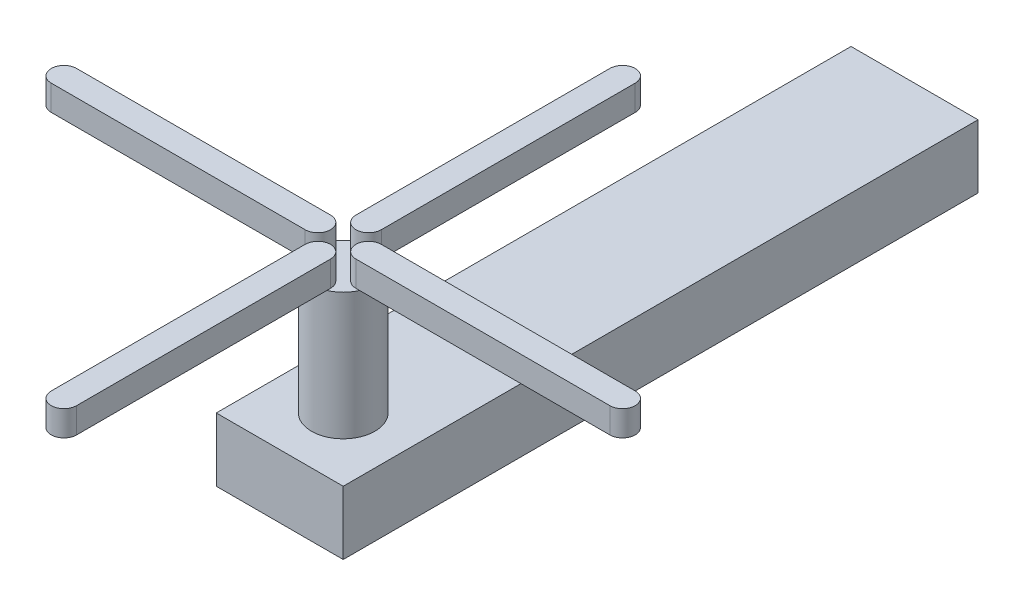
ISO-10303-21;
HEADER;
FILE_DESCRIPTION(('STEP AP214'),'2;1');
FILE_NAME('part.step','',(''),(''),'','','');
FILE_SCHEMA(('AUTOMOTIVE_DESIGN { 1 0 10303 214 1 1 1 1 }'));
ENDSEC;
DATA;
#1=APPLICATION_CONTEXT('core data for automotive mechanical design processes');
#2=APPLICATION_PROTOCOL_DEFINITION('international standard','automotive_design',2000,#1);
#3=PRODUCT_CONTEXT('',#1,'mechanical');
#4=PRODUCT('Part','Part','',(#3));
#5=PRODUCT_RELATED_PRODUCT_CATEGORY('part','',(#4));
#6=PRODUCT_DEFINITION_FORMATION('','',#4);
#7=PRODUCT_DEFINITION_CONTEXT('part definition',#1,'design');
#8=PRODUCT_DEFINITION('design','',#6,#7);
#9=PRODUCT_DEFINITION_SHAPE('','',#8);
#10=(LENGTH_UNIT() NAMED_UNIT(*) SI_UNIT(.MILLI.,.METRE.));
#11=(NAMED_UNIT(*) PLANE_ANGLE_UNIT() SI_UNIT($,.RADIAN.));
#12=(NAMED_UNIT(*) SI_UNIT($,.STERADIAN.) SOLID_ANGLE_UNIT());
#13=UNCERTAINTY_MEASURE_WITH_UNIT(LENGTH_MEASURE(1.E-05),#10,'distance_accuracy_value','');
#14=(GEOMETRIC_REPRESENTATION_CONTEXT(3) GLOBAL_UNCERTAINTY_ASSIGNED_CONTEXT((#13)) GLOBAL_UNIT_ASSIGNED_CONTEXT((#10,
#11,#12)) REPRESENTATION_CONTEXT('',''));
#15=CARTESIAN_POINT('',(0.,0.,0.));
#16=DIRECTION('',(0.,0.,1.));
#17=DIRECTION('',(1.,0.,0.));
#18=AXIS2_PLACEMENT_3D('',#15,#16,#17);
#19=CARTESIAN_POINT('',(0.,31.75,114.3));
#20=DIRECTION('',(0.,1.,0.));
#21=DIRECTION('',(0.,0.,1.));
#22=AXIS2_PLACEMENT_3D('',#19,#20,#21);
#23=PLANE('',#22);
#24=CARTESIAN_POINT('',(0.,31.75,114.3));
#25=DIRECTION('',(0.,1.,0.));
#26=DIRECTION('',(0.,0.,1.));
#27=AXIS2_PLACEMENT_3D('',#24,#25,#26);
#28=CIRCLE('',#27,6.35);
#29=CARTESIAN_POINT('',(5.81987113259391,31.75,111.76));
#30=VERTEX_POINT('',#29);
#31=CARTESIAN_POINT('',(2.54000000000006,31.75,108.480128867406));
#32=VERTEX_POINT('',#31);
#33=EDGE_CURVE('E341',#30,#32,#28,.T.);
#34=ORIENTED_EDGE('',*,*,#33,.T.);
#35=DIRECTION('',(0.,0.,-1.));
#36=VECTOR('',#35,1.);
#37=CARTESIAN_POINT('',(2.54000000000006,31.75,109.22));
#38=LINE('',#37,#36);
#39=CARTESIAN_POINT('',(2.54000000000006,31.75,109.22));
#40=VERTEX_POINT('',#39);
#41=EDGE_CURVE('E52',#40,#32,#38,.T.);
#42=ORIENTED_EDGE('',*,*,#41,.F.);
#43=CARTESIAN_POINT('',(0.,31.75,109.22));
#44=DIRECTION('',(0.,1.,0.));
#45=DIRECTION('',(0.,0.,1.));
#46=AXIS2_PLACEMENT_3D('',#43,#44,#45);
#47=CIRCLE('',#46,2.54);
#48=CARTESIAN_POINT('',(-2.53999999999994,31.75,109.22));
#49=VERTEX_POINT('',#48);
#50=EDGE_CURVE('E57',#49,#40,#47,.T.);
#51=ORIENTED_EDGE('',*,*,#50,.F.);
#52=DIRECTION('',(0.,0.,1.));
#53=VECTOR('',#52,1.);
#54=CARTESIAN_POINT('',(-2.53999999999994,31.75,109.22));
#55=LINE('',#54,#53);
#56=CARTESIAN_POINT('',(-2.53999999999994,31.75,108.480128867406));
#57=VERTEX_POINT('',#56);
#58=EDGE_CURVE('E224',#57,#49,#55,.T.);
#59=ORIENTED_EDGE('',*,*,#58,.F.);
#60=CARTESIAN_POINT('',(-5.81987113259388,31.75,111.76));
#61=VERTEX_POINT('',#60);
#62=EDGE_CURVE('E342',#57,#61,#28,.T.);
#63=ORIENTED_EDGE('',*,*,#62,.T.);
#64=DIRECTION('',(-1.,0.,0.));
#65=VECTOR('',#64,1.);
#66=CARTESIAN_POINT('',(-5.07999999999998,31.75,111.76));
#67=LINE('',#66,#65);
#68=CARTESIAN_POINT('',(-5.07999999999998,31.75,111.76));
#69=VERTEX_POINT('',#68);
#70=EDGE_CURVE('E258',#69,#61,#67,.T.);
#71=ORIENTED_EDGE('',*,*,#70,.F.);
#72=CARTESIAN_POINT('',(-5.08,31.75,114.3));
#73=DIRECTION('',(0.,1.,0.));
#74=DIRECTION('',(0.,0.,1.));
#75=AXIS2_PLACEMENT_3D('',#72,#73,#74);
#76=CIRCLE('',#75,2.54);
#77=CARTESIAN_POINT('',(-5.08000000000002,31.75,116.84));
#78=VERTEX_POINT('',#77);
#79=EDGE_CURVE('E261',#78,#69,#76,.T.);
#80=ORIENTED_EDGE('',*,*,#79,.F.);
#81=DIRECTION('',(1.,0.,0.));
#82=VECTOR('',#81,1.);
#83=CARTESIAN_POINT('',(-5.08000000000002,31.75,116.84));
#84=LINE('',#83,#82);
#85=CARTESIAN_POINT('',(-5.81987113259395,31.75,116.84));
#86=VERTEX_POINT('',#85);
#87=EDGE_CURVE('E255',#86,#78,#84,.T.);
#88=ORIENTED_EDGE('',*,*,#87,.F.);
#89=CARTESIAN_POINT('',(-2.54000000000002,31.75,120.119871132594));
#90=VERTEX_POINT('',#89);
#91=EDGE_CURVE('E402',#86,#90,#28,.T.);
#92=ORIENTED_EDGE('',*,*,#91,.T.);
#93=DIRECTION('',(0.,0.,1.));
#94=VECTOR('',#93,1.);
#95=CARTESIAN_POINT('',(-2.54000000000001,31.75,119.38));
#96=LINE('',#95,#94);
#97=CARTESIAN_POINT('',(-2.54000000000001,31.75,119.38));
#98=VERTEX_POINT('',#97);
#99=EDGE_CURVE('E290',#98,#90,#96,.T.);
#100=ORIENTED_EDGE('',*,*,#99,.F.);
#101=CARTESIAN_POINT('',(0.,31.75,119.38));
#102=DIRECTION('',(0.,1.,0.));
#103=DIRECTION('',(0.,0.,1.));
#104=AXIS2_PLACEMENT_3D('',#101,#102,#103);
#105=CIRCLE('',#104,2.54);
#106=CARTESIAN_POINT('',(2.53999999999999,31.75,119.38));
#107=VERTEX_POINT('',#106);
#108=EDGE_CURVE('E293',#107,#98,#105,.T.);
#109=ORIENTED_EDGE('',*,*,#108,.F.);
#110=DIRECTION('',(0.,0.,1.));
#111=VECTOR('',#110,1.);
#112=CARTESIAN_POINT('',(2.54,31.75,114.3));
#113=LINE('',#112,#111);
#114=CARTESIAN_POINT('',(2.53999999999998,31.75,120.119871132594));
#115=VERTEX_POINT('',#114);
#116=EDGE_CURVE('E11',#107,#115,#113,.T.);
#117=ORIENTED_EDGE('',*,*,#116,.T.);
#118=CARTESIAN_POINT('',(5.81987113259391,31.75,116.84));
#119=VERTEX_POINT('',#118);
#120=EDGE_CURVE('E336',#115,#119,#28,.T.);
#121=ORIENTED_EDGE('',*,*,#120,.T.);
#122=DIRECTION('',(1.,0.,0.));
#123=VECTOR('',#122,1.);
#124=CARTESIAN_POINT('',(5.08,31.75,116.84));
#125=LINE('',#124,#123);
#126=CARTESIAN_POINT('',(5.08,31.75,116.84));
#127=VERTEX_POINT('',#126);
#128=EDGE_CURVE('E318',#127,#119,#125,.T.);
#129=ORIENTED_EDGE('',*,*,#128,.F.);
#130=CARTESIAN_POINT('',(5.08,31.75,114.3));
#131=DIRECTION('',(0.,1.,0.));
#132=DIRECTION('',(0.,0.,1.));
#133=AXIS2_PLACEMENT_3D('',#130,#131,#132);
#134=CIRCLE('',#133,2.54);
#135=CARTESIAN_POINT('',(5.08,31.75,111.76));
#136=VERTEX_POINT('',#135);
#137=EDGE_CURVE('E296',#136,#127,#134,.T.);
#138=ORIENTED_EDGE('',*,*,#137,.F.);
#139=DIRECTION('',(-1.,0.,0.));
#140=VECTOR('',#139,1.);
#141=CARTESIAN_POINT('',(5.08,31.75,111.76));
#142=LINE('',#141,#140);
#143=EDGE_CURVE('E45',#30,#136,#142,.T.);
#144=ORIENTED_EDGE('',*,*,#143,.F.);
#145=EDGE_LOOP('',(#34,#42,#51,#59,#63,#71,#80,#88,#92,#100,#109,#117,#121,#129,#138,#144));
#146=FACE_BOUND('',#145,.T.);
#147=ADVANCED_FACE('F37',(#146),#23,.T.);
#148=CARTESIAN_POINT('',(-12.7,6.35,127.));
#149=DIRECTION('',(1.,0.,0.));
#150=DIRECTION('',(0.,0.,-1.));
#151=AXIS2_PLACEMENT_3D('',#148,#149,#150);
#152=PLANE('',#151);
#153=DIRECTION('',(0.,-1.,0.));
#154=VECTOR('',#153,1.);
#155=CARTESIAN_POINT('',(-12.7,6.35,0.));
#156=LINE('',#155,#154);
#157=CARTESIAN_POINT('',(-12.7,6.35,0.));
#158=VERTEX_POINT('',#157);
#159=CARTESIAN_POINT('',(-12.7,-6.35,0.));
#160=VERTEX_POINT('',#159);
#161=EDGE_CURVE('E340',#158,#160,#156,.T.);
#162=ORIENTED_EDGE('',*,*,#161,.T.);
#163=DIRECTION('',(0.,0.,-1.));
#164=VECTOR('',#163,1.);
#165=CARTESIAN_POINT('',(-12.7,-6.35,127.));
#166=LINE('',#165,#164);
#167=CARTESIAN_POINT('',(-12.7,-6.35,127.));
#168=VERTEX_POINT('',#167);
#169=EDGE_CURVE('E369',#168,#160,#166,.T.);
#170=ORIENTED_EDGE('',*,*,#169,.F.);
#171=DIRECTION('',(0.,-1.,0.));
#172=VECTOR('',#171,1.);
#173=CARTESIAN_POINT('',(-12.7,6.35,127.));
#174=LINE('',#173,#172);
#175=CARTESIAN_POINT('',(-12.7,6.35,127.));
#176=VERTEX_POINT('',#175);
#177=EDGE_CURVE('E343',#176,#168,#174,.T.);
#178=ORIENTED_EDGE('',*,*,#177,.F.);
#179=DIRECTION('',(0.,0.,-1.));
#180=VECTOR('',#179,1.);
#181=CARTESIAN_POINT('',(-12.7,6.35,127.));
#182=LINE('',#181,#180);
#183=EDGE_CURVE('E353',#176,#158,#182,.T.);
#184=ORIENTED_EDGE('',*,*,#183,.T.);
#185=EDGE_LOOP('',(#162,#170,#178,#184));
#186=FACE_BOUND('',#185,.T.);
#187=ADVANCED_FACE('F39',(#186),#152,.F.);
#188=CARTESIAN_POINT('',(-12.7,-6.35,127.));
#189=DIRECTION('',(0.,1.,0.));
#190=DIRECTION('',(0.,0.,1.));
#191=AXIS2_PLACEMENT_3D('',#188,#189,#190);
#192=PLANE('',#191);
#193=DIRECTION('',(1.,0.,0.));
#194=VECTOR('',#193,1.);
#195=CARTESIAN_POINT('',(-12.7,-6.35,0.));
#196=LINE('',#195,#194);
#197=CARTESIAN_POINT('',(12.7,-6.35,0.));
#198=VERTEX_POINT('',#197);
#199=EDGE_CURVE('E356',#160,#198,#196,.T.);
#200=ORIENTED_EDGE('',*,*,#199,.T.);
#201=DIRECTION('',(0.,0.,-1.));
#202=VECTOR('',#201,1.);
#203=CARTESIAN_POINT('',(12.7,-6.35,127.));
#204=LINE('',#203,#202);
#205=CARTESIAN_POINT('',(12.7,-6.35,127.));
#206=VERTEX_POINT('',#205);
#207=EDGE_CURVE('E366',#206,#198,#204,.T.);
#208=ORIENTED_EDGE('',*,*,#207,.F.);
#209=DIRECTION('',(1.,0.,0.));
#210=VECTOR('',#209,1.);
#211=CARTESIAN_POINT('',(-12.7,-6.35,127.));
#212=LINE('',#211,#210);
#213=EDGE_CURVE('E346',#168,#206,#212,.T.);
#214=ORIENTED_EDGE('',*,*,#213,.F.);
#215=ORIENTED_EDGE('',*,*,#169,.T.);
#216=EDGE_LOOP('',(#200,#208,#214,#215));
#217=FACE_BOUND('',#216,.T.);
#218=ADVANCED_FACE('F449',(#217),#192,.F.);
#219=CARTESIAN_POINT('',(12.7,6.35,127.));
#220=DIRECTION('',(-1.,0.,0.));
#221=DIRECTION('',(0.,0.,1.));
#222=AXIS2_PLACEMENT_3D('',#219,#220,#221);
#223=PLANE('',#222);
#224=DIRECTION('',(0.,1.,0.));
#225=VECTOR('',#224,1.);
#226=CARTESIAN_POINT('',(12.7,6.35,0.));
#227=LINE('',#226,#225);
#228=CARTESIAN_POINT('',(12.7,6.35,0.));
#229=VERTEX_POINT('',#228);
#230=EDGE_CURVE('E358',#198,#229,#227,.T.);
#231=ORIENTED_EDGE('',*,*,#230,.T.);
#232=DIRECTION('',(0.,0.,-1.));
#233=VECTOR('',#232,1.);
#234=CARTESIAN_POINT('',(12.7,6.35,127.));
#235=LINE('',#234,#233);
#236=CARTESIAN_POINT('',(12.7,6.35,127.));
#237=VERTEX_POINT('',#236);
#238=EDGE_CURVE('E363',#237,#229,#235,.T.);
#239=ORIENTED_EDGE('',*,*,#238,.F.);
#240=DIRECTION('',(0.,1.,0.));
#241=VECTOR('',#240,1.);
#242=CARTESIAN_POINT('',(12.7,6.35,127.));
#243=LINE('',#242,#241);
#244=EDGE_CURVE('E349',#206,#237,#243,.T.);
#245=ORIENTED_EDGE('',*,*,#244,.F.);
#246=ORIENTED_EDGE('',*,*,#207,.T.);
#247=EDGE_LOOP('',(#231,#239,#245,#246));
#248=FACE_BOUND('',#247,.T.);
#249=ADVANCED_FACE('F467',(#248),#223,.F.);
#250=CARTESIAN_POINT('',(-12.7,6.35,127.));
#251=DIRECTION('',(0.,-1.,0.));
#252=DIRECTION('',(0.,0.,-1.));
#253=AXIS2_PLACEMENT_3D('',#250,#251,#252);
#254=PLANE('',#253);
#255=CARTESIAN_POINT('',(0.,6.35,114.3));
#256=DIRECTION('',(0.,-1.,0.));
#257=DIRECTION('',(0.,0.,-1.));
#258=AXIS2_PLACEMENT_3D('',#255,#256,#257);
#259=CIRCLE('',#258,6.35);
#260=CARTESIAN_POINT('',(0.,6.35,107.95));
#261=VERTEX_POINT('',#260);
#262=EDGE_CURVE('E371',#261,#261,#259,.F.);
#263=ORIENTED_EDGE('',*,*,#262,.F.);
#264=EDGE_LOOP('',(#263));
#265=FACE_BOUND('',#264,.T.);
#266=DIRECTION('',(-1.,0.,0.));
#267=VECTOR('',#266,1.);
#268=CARTESIAN_POINT('',(-12.7,6.35,0.));
#269=LINE('',#268,#267);
#270=EDGE_CURVE('E347',#229,#158,#269,.T.);
#271=ORIENTED_EDGE('',*,*,#270,.T.);
#272=ORIENTED_EDGE('',*,*,#183,.F.);
#273=DIRECTION('',(-1.,0.,0.));
#274=VECTOR('',#273,1.);
#275=CARTESIAN_POINT('',(-12.7,6.35,127.));
#276=LINE('',#275,#274);
#277=EDGE_CURVE('E351',#237,#176,#276,.T.);
#278=ORIENTED_EDGE('',*,*,#277,.F.);
#279=ORIENTED_EDGE('',*,*,#238,.T.);
#280=EDGE_LOOP('',(#271,#272,#278,#279));
#281=FACE_BOUND('',#280,.T.);
#282=ADVANCED_FACE('F460',(#265,#281),#254,.F.);
#283=CARTESIAN_POINT('',(0.,0.,127.));
#284=DIRECTION('',(0.,0.,1.));
#285=DIRECTION('',(1.,0.,0.));
#286=AXIS2_PLACEMENT_3D('',#283,#284,#285);
#287=PLANE('',#286);
#288=ORIENTED_EDGE('',*,*,#177,.T.);
#289=ORIENTED_EDGE('',*,*,#213,.T.);
#290=ORIENTED_EDGE('',*,*,#244,.T.);
#291=ORIENTED_EDGE('',*,*,#277,.T.);
#292=EDGE_LOOP('',(#288,#289,#290,#291));
#293=FACE_BOUND('',#292,.T.);
#294=ADVANCED_FACE('F457',(#293),#287,.T.);
#295=CARTESIAN_POINT('',(0.,0.,0.));
#296=DIRECTION('',(0.,0.,1.));
#297=DIRECTION('',(1.,0.,0.));
#298=AXIS2_PLACEMENT_3D('',#295,#296,#297);
#299=PLANE('',#298);
#300=ORIENTED_EDGE('',*,*,#161,.F.);
#301=ORIENTED_EDGE('',*,*,#270,.F.);
#302=ORIENTED_EDGE('',*,*,#230,.F.);
#303=ORIENTED_EDGE('',*,*,#199,.F.);
#304=EDGE_LOOP('',(#300,#301,#302,#303));
#305=FACE_BOUND('',#304,.T.);
#306=ADVANCED_FACE('F456',(#305),#299,.F.);
#307=CARTESIAN_POINT('',(0.,31.75,114.3));
#308=DIRECTION('',(0.,-1.,0.));
#309=DIRECTION('',(0.,0.,-1.));
#310=AXIS2_PLACEMENT_3D('',#307,#308,#309);
#311=CYLINDRICAL_SURFACE('',#310,6.35);
#312=EDGE_CURVE('E337',#119,#30,#28,.T.);
#313=ORIENTED_EDGE('',*,*,#312,.F.);
#314=ORIENTED_EDGE('',*,*,#120,.F.);
#315=EDGE_CURVE('E401',#90,#115,#28,.T.);
#316=ORIENTED_EDGE('',*,*,#315,.F.);
#317=ORIENTED_EDGE('',*,*,#91,.F.);
#318=EDGE_CURVE('E407',#61,#86,#28,.T.);
#319=ORIENTED_EDGE('',*,*,#318,.F.);
#320=ORIENTED_EDGE('',*,*,#62,.F.);
#321=EDGE_CURVE('E223',#32,#57,#28,.T.);
#322=ORIENTED_EDGE('',*,*,#321,.F.);
#323=ORIENTED_EDGE('',*,*,#33,.F.);
#324=EDGE_LOOP('',(#313,#314,#316,#317,#319,#320,#322,#323));
#325=FACE_BOUND('',#324,.T.);
#326=ORIENTED_EDGE('',*,*,#262,.T.);
#327=EDGE_LOOP('',(#326));
#328=FACE_BOUND('',#327,.T.);
#329=ADVANCED_FACE('F399',(#325,#328),#311,.T.);
#330=CARTESIAN_POINT('',(5.08,31.75,114.3));
#331=DIRECTION('',(0.,1.,0.));
#332=DIRECTION('',(0.,0.,1.));
#333=AXIS2_PLACEMENT_3D('',#330,#331,#332);
#334=PLANE('',#333);
#335=CARTESIAN_POINT('',(55.88,31.75,116.84));
#336=VERTEX_POINT('',#335);
#337=EDGE_CURVE('E317',#119,#336,#125,.T.);
#338=ORIENTED_EDGE('',*,*,#337,.F.);
#339=ORIENTED_EDGE('',*,*,#312,.T.);
#340=CARTESIAN_POINT('',(55.88,31.75,111.76));
#341=VERTEX_POINT('',#340);
#342=EDGE_CURVE('E308',#341,#30,#142,.T.);
#343=ORIENTED_EDGE('',*,*,#342,.F.);
#344=CARTESIAN_POINT('',(55.88,31.75,114.3));
#345=DIRECTION('',(0.,1.,0.));
#346=DIRECTION('',(0.,0.,1.));
#347=AXIS2_PLACEMENT_3D('',#344,#345,#346);
#348=CIRCLE('',#347,2.54);
#349=EDGE_CURVE('E321',#336,#341,#348,.T.);
#350=ORIENTED_EDGE('',*,*,#349,.F.);
#351=EDGE_LOOP('',(#338,#339,#343,#350));
#352=FACE_BOUND('',#351,.T.);
#353=ADVANCED_FACE('F395',(#352),#334,.F.);
#354=CARTESIAN_POINT('',(5.08,36.83,114.3));
#355=DIRECTION('',(0.,-1.,0.));
#356=DIRECTION('',(0.,0.,-1.));
#357=AXIS2_PLACEMENT_3D('',#354,#355,#356);
#358=CYLINDRICAL_SURFACE('',#357,2.54);
#359=ORIENTED_EDGE('',*,*,#137,.T.);
#360=DIRECTION('',(0.,-1.,0.));
#361=VECTOR('',#360,1.);
#362=CARTESIAN_POINT('',(5.08,36.83,116.84));
#363=LINE('',#362,#361);
#364=CARTESIAN_POINT('',(5.08,36.83,116.84));
#365=VERTEX_POINT('',#364);
#366=EDGE_CURVE('E333',#365,#127,#363,.T.);
#367=ORIENTED_EDGE('',*,*,#366,.F.);
#368=CARTESIAN_POINT('',(5.08,36.83,114.3));
#369=DIRECTION('',(0.,1.,0.));
#370=DIRECTION('',(0.,0.,1.));
#371=AXIS2_PLACEMENT_3D('',#368,#369,#370);
#372=CIRCLE('',#371,2.54);
#373=CARTESIAN_POINT('',(5.08,36.83,111.76));
#374=VERTEX_POINT('',#373);
#375=EDGE_CURVE('E304',#374,#365,#372,.T.);
#376=ORIENTED_EDGE('',*,*,#375,.F.);
#377=DIRECTION('',(0.,-1.,0.));
#378=VECTOR('',#377,1.);
#379=CARTESIAN_POINT('',(5.08,36.83,111.76));
#380=LINE('',#379,#378);
#381=EDGE_CURVE('E314',#374,#136,#380,.T.);
#382=ORIENTED_EDGE('',*,*,#381,.T.);
#383=EDGE_LOOP('',(#359,#367,#376,#382));
#384=FACE_BOUND('',#383,.T.);
#385=ADVANCED_FACE('F384',(#384),#358,.T.);
#386=CARTESIAN_POINT('',(5.08,36.83,116.84));
#387=DIRECTION('',(0.,0.,-1.));
#388=DIRECTION('',(-1.,0.,0.));
#389=AXIS2_PLACEMENT_3D('',#386,#387,#388);
#390=PLANE('',#389);
#391=ORIENTED_EDGE('',*,*,#128,.T.);
#392=ORIENTED_EDGE('',*,*,#337,.T.);
#393=DIRECTION('',(0.,-1.,0.));
#394=VECTOR('',#393,1.);
#395=CARTESIAN_POINT('',(55.88,36.83,116.84));
#396=LINE('',#395,#394);
#397=CARTESIAN_POINT('',(55.88,36.83,116.84));
#398=VERTEX_POINT('',#397);
#399=EDGE_CURVE('E330',#398,#336,#396,.T.);
#400=ORIENTED_EDGE('',*,*,#399,.F.);
#401=DIRECTION('',(1.,0.,0.));
#402=VECTOR('',#401,1.);
#403=CARTESIAN_POINT('',(5.08,36.83,116.84));
#404=LINE('',#403,#402);
#405=EDGE_CURVE('E307',#365,#398,#404,.T.);
#406=ORIENTED_EDGE('',*,*,#405,.F.);
#407=ORIENTED_EDGE('',*,*,#366,.T.);
#408=EDGE_LOOP('',(#391,#392,#400,#406,#407));
#409=FACE_BOUND('',#408,.T.);
#410=ADVANCED_FACE('F520',(#409),#390,.F.);
#411=CARTESIAN_POINT('',(55.88,36.83,114.3));
#412=DIRECTION('',(0.,-1.,0.));
#413=DIRECTION('',(0.,0.,-1.));
#414=AXIS2_PLACEMENT_3D('',#411,#412,#413);
#415=CYLINDRICAL_SURFACE('',#414,2.54);
#416=ORIENTED_EDGE('',*,*,#349,.T.);
#417=DIRECTION('',(0.,-1.,0.));
#418=VECTOR('',#417,1.);
#419=CARTESIAN_POINT('',(55.88,36.83,111.76));
#420=LINE('',#419,#418);
#421=CARTESIAN_POINT('',(55.88,36.83,111.76));
#422=VERTEX_POINT('',#421);
#423=EDGE_CURVE('E327',#422,#341,#420,.T.);
#424=ORIENTED_EDGE('',*,*,#423,.F.);
#425=CARTESIAN_POINT('',(55.88,36.83,114.3));
#426=DIRECTION('',(0.,1.,0.));
#427=DIRECTION('',(0.,0.,1.));
#428=AXIS2_PLACEMENT_3D('',#425,#426,#427);
#429=CIRCLE('',#428,2.54);
#430=EDGE_CURVE('E310',#398,#422,#429,.T.);
#431=ORIENTED_EDGE('',*,*,#430,.F.);
#432=ORIENTED_EDGE('',*,*,#399,.T.);
#433=EDGE_LOOP('',(#416,#424,#431,#432));
#434=FACE_BOUND('',#433,.T.);
#435=ADVANCED_FACE('F526',(#434),#415,.T.);
#436=CARTESIAN_POINT('',(5.08,36.83,111.76));
#437=DIRECTION('',(0.,0.,1.));
#438=DIRECTION('',(1.,0.,0.));
#439=AXIS2_PLACEMENT_3D('',#436,#437,#438);
#440=PLANE('',#439);
#441=ORIENTED_EDGE('',*,*,#342,.T.);
#442=ORIENTED_EDGE('',*,*,#143,.T.);
#443=ORIENTED_EDGE('',*,*,#381,.F.);
#444=DIRECTION('',(-1.,0.,0.));
#445=VECTOR('',#444,1.);
#446=CARTESIAN_POINT('',(5.08,36.83,111.76));
#447=LINE('',#446,#445);
#448=EDGE_CURVE('E312',#422,#374,#447,.T.);
#449=ORIENTED_EDGE('',*,*,#448,.F.);
#450=ORIENTED_EDGE('',*,*,#423,.T.);
#451=EDGE_LOOP('',(#441,#442,#443,#449,#450));
#452=FACE_BOUND('',#451,.T.);
#453=ADVANCED_FACE('F378',(#452),#440,.F.);
#454=CARTESIAN_POINT('',(5.08,36.83,114.3));
#455=DIRECTION('',(0.,1.,0.));
#456=DIRECTION('',(0.,0.,1.));
#457=AXIS2_PLACEMENT_3D('',#454,#455,#456);
#458=PLANE('',#457);
#459=ORIENTED_EDGE('',*,*,#375,.T.);
#460=ORIENTED_EDGE('',*,*,#405,.T.);
#461=ORIENTED_EDGE('',*,*,#430,.T.);
#462=ORIENTED_EDGE('',*,*,#448,.T.);
#463=EDGE_LOOP('',(#459,#460,#461,#462));
#464=FACE_BOUND('',#463,.T.);
#465=ADVANCED_FACE('F387',(#464),#458,.T.);
#466=CARTESIAN_POINT('',(0.,36.83,119.38));
#467=DIRECTION('',(0.,-1.,0.));
#468=DIRECTION('',(0.,0.,-1.));
#469=AXIS2_PLACEMENT_3D('',#466,#467,#468);
#470=CYLINDRICAL_SURFACE('',#469,2.54);
#471=ORIENTED_EDGE('',*,*,#108,.T.);
#472=DIRECTION('',(0.,-1.,0.));
#473=VECTOR('',#472,1.);
#474=CARTESIAN_POINT('',(-2.54000000000001,36.83,119.38));
#475=LINE('',#474,#473);
#476=CARTESIAN_POINT('',(-2.54000000000001,36.83,119.38));
#477=VERTEX_POINT('',#476);
#478=EDGE_CURVE('E264',#477,#98,#475,.T.);
#479=ORIENTED_EDGE('',*,*,#478,.F.);
#480=CARTESIAN_POINT('',(0.,36.83,119.38));
#481=DIRECTION('',(0.,1.,0.));
#482=DIRECTION('',(0.,0.,1.));
#483=AXIS2_PLACEMENT_3D('',#480,#481,#482);
#484=CIRCLE('',#483,2.54);
#485=CARTESIAN_POINT('',(2.53999999999999,36.83,119.38));
#486=VERTEX_POINT('',#485);
#487=EDGE_CURVE('E287',#486,#477,#484,.T.);
#488=ORIENTED_EDGE('',*,*,#487,.F.);
#489=DIRECTION('',(0.,-1.,0.));
#490=VECTOR('',#489,1.);
#491=CARTESIAN_POINT('',(2.53999999999999,36.83,119.38));
#492=LINE('',#491,#490);
#493=EDGE_CURVE('E280',#486,#107,#492,.T.);
#494=ORIENTED_EDGE('',*,*,#493,.T.);
#495=EDGE_LOOP('',(#471,#479,#488,#494));
#496=FACE_BOUND('',#495,.T.);
#497=ADVANCED_FACE('F545',(#496),#470,.T.);
#498=CARTESIAN_POINT('',(-2.54000000000001,36.83,119.38));
#499=DIRECTION('',(1.,0.,0.));
#500=DIRECTION('',(0.,0.,-1.));
#501=AXIS2_PLACEMENT_3D('',#498,#499,#500);
#502=PLANE('',#501);
#503=ORIENTED_EDGE('',*,*,#99,.T.);
#504=CARTESIAN_POINT('',(-2.54000000000019,31.75,170.18));
#505=VERTEX_POINT('',#504);
#506=EDGE_CURVE('E289',#90,#505,#96,.T.);
#507=ORIENTED_EDGE('',*,*,#506,.T.);
#508=DIRECTION('',(0.,-1.,0.));
#509=VECTOR('',#508,1.);
#510=CARTESIAN_POINT('',(-2.54000000000019,36.83,170.18));
#511=LINE('',#510,#509);
#512=CARTESIAN_POINT('',(-2.54000000000019,36.83,170.18));
#513=VERTEX_POINT('',#512);
#514=EDGE_CURVE('E274',#513,#505,#511,.T.);
#515=ORIENTED_EDGE('',*,*,#514,.F.);
#516=DIRECTION('',(0.,0.,1.));
#517=VECTOR('',#516,1.);
#518=CARTESIAN_POINT('',(-2.54000000000001,36.83,119.38));
#519=LINE('',#518,#517);
#520=EDGE_CURVE('E300',#477,#513,#519,.T.);
#521=ORIENTED_EDGE('',*,*,#520,.F.);
#522=ORIENTED_EDGE('',*,*,#478,.T.);
#523=EDGE_LOOP('',(#503,#507,#515,#521,#522));
#524=FACE_BOUND('',#523,.T.);
#525=ADVANCED_FACE('F552',(#524),#502,.F.);
#526=CARTESIAN_POINT('',(-1.94289029309402E-13,36.83,170.18));
#527=DIRECTION('',(0.,-1.,0.));
#528=DIRECTION('',(0.,0.,-1.));
#529=AXIS2_PLACEMENT_3D('',#526,#527,#528);
#530=CYLINDRICAL_SURFACE('',#529,2.54);
#531=CARTESIAN_POINT('',(-1.94289029309402E-13,31.75,170.18));
#532=DIRECTION('',(0.,1.,0.));
#533=DIRECTION('',(0.,0.,1.));
#534=AXIS2_PLACEMENT_3D('',#531,#532,#533);
#535=CIRCLE('',#534,2.54);
#536=CARTESIAN_POINT('',(2.53999999999981,31.75,170.18));
#537=VERTEX_POINT('',#536);
#538=EDGE_CURVE('E286',#505,#537,#535,.T.);
#539=ORIENTED_EDGE('',*,*,#538,.T.);
#540=DIRECTION('',(0.,-1.,0.));
#541=VECTOR('',#540,1.);
#542=CARTESIAN_POINT('',(2.53999999999981,36.83,170.18));
#543=LINE('',#542,#541);
#544=CARTESIAN_POINT('',(2.53999999999981,36.83,170.18));
#545=VERTEX_POINT('',#544);
#546=EDGE_CURVE('E277',#545,#537,#543,.T.);
#547=ORIENTED_EDGE('',*,*,#546,.F.);
#548=CARTESIAN_POINT('',(-1.94289029309402E-13,36.83,170.18));
#549=DIRECTION('',(0.,1.,0.));
#550=DIRECTION('',(0.,0.,1.));
#551=AXIS2_PLACEMENT_3D('',#548,#549,#550);
#552=CIRCLE('',#551,2.54);
#553=EDGE_CURVE('E298',#513,#545,#552,.T.);
#554=ORIENTED_EDGE('',*,*,#553,.F.);
#555=ORIENTED_EDGE('',*,*,#514,.T.);
#556=EDGE_LOOP('',(#539,#547,#554,#555));
#557=FACE_BOUND('',#556,.T.);
#558=ADVANCED_FACE('F559',(#557),#530,.T.);
#559=CARTESIAN_POINT('',(2.53999999999999,36.83,119.38));
#560=DIRECTION('',(-1.,0.,0.));
#561=DIRECTION('',(0.,0.,1.));
#562=AXIS2_PLACEMENT_3D('',#559,#560,#561);
#563=PLANE('',#562);
#564=DIRECTION('',(0.,0.,-1.));
#565=VECTOR('',#564,1.);
#566=CARTESIAN_POINT('',(2.53999999999999,31.75,119.38));
#567=LINE('',#566,#565);
#568=EDGE_CURVE('E284',#537,#115,#567,.T.);
#569=ORIENTED_EDGE('',*,*,#568,.T.);
#570=ORIENTED_EDGE('',*,*,#116,.F.);
#571=ORIENTED_EDGE('',*,*,#493,.F.);
#572=DIRECTION('',(0.,0.,-1.));
#573=VECTOR('',#572,1.);
#574=CARTESIAN_POINT('',(2.53999999999999,36.83,119.38));
#575=LINE('',#574,#573);
#576=EDGE_CURVE('E283',#545,#486,#575,.T.);
#577=ORIENTED_EDGE('',*,*,#576,.F.);
#578=ORIENTED_EDGE('',*,*,#546,.T.);
#579=EDGE_LOOP('',(#569,#570,#571,#577,#578));
#580=FACE_BOUND('',#579,.T.);
#581=ADVANCED_FACE('F567',(#580),#563,.F.);
#582=CARTESIAN_POINT('',(0.,36.83,119.38));
#583=DIRECTION('',(0.,1.,0.));
#584=DIRECTION('',(0.,0.,1.));
#585=AXIS2_PLACEMENT_3D('',#582,#583,#584);
#586=PLANE('',#585);
#587=ORIENTED_EDGE('',*,*,#487,.T.);
#588=ORIENTED_EDGE('',*,*,#520,.T.);
#589=ORIENTED_EDGE('',*,*,#553,.T.);
#590=ORIENTED_EDGE('',*,*,#576,.T.);
#591=EDGE_LOOP('',(#587,#588,#589,#590));
#592=FACE_BOUND('',#591,.T.);
#593=ADVANCED_FACE('F575',(#592),#586,.T.);
#594=CARTESIAN_POINT('',(0.,31.75,119.38));
#595=DIRECTION('',(0.,1.,0.));
#596=DIRECTION('',(0.,0.,1.));
#597=AXIS2_PLACEMENT_3D('',#594,#595,#596);
#598=PLANE('',#597);
#599=ORIENTED_EDGE('',*,*,#506,.F.);
#600=ORIENTED_EDGE('',*,*,#315,.T.);
#601=ORIENTED_EDGE('',*,*,#568,.F.);
#602=ORIENTED_EDGE('',*,*,#538,.F.);
#603=EDGE_LOOP('',(#599,#600,#601,#602));
#604=FACE_BOUND('',#603,.T.);
#605=ADVANCED_FACE('F583',(#604),#598,.F.);
#606=CARTESIAN_POINT('',(-5.08,36.83,114.3));
#607=DIRECTION('',(0.,-1.,0.));
#608=DIRECTION('',(0.,0.,-1.));
#609=AXIS2_PLACEMENT_3D('',#606,#607,#608);
#610=CYLINDRICAL_SURFACE('',#609,2.54);
#611=ORIENTED_EDGE('',*,*,#79,.T.);
#612=DIRECTION('',(0.,-1.,0.));
#613=VECTOR('',#612,1.);
#614=CARTESIAN_POINT('',(-5.07999999999998,36.83,111.76));
#615=LINE('',#614,#613);
#616=CARTESIAN_POINT('',(-5.07999999999998,36.83,111.76));
#617=VERTEX_POINT('',#616);
#618=EDGE_CURVE('E231',#617,#69,#615,.T.);
#619=ORIENTED_EDGE('',*,*,#618,.F.);
#620=CARTESIAN_POINT('',(-5.08,36.83,114.3));
#621=DIRECTION('',(0.,1.,0.));
#622=DIRECTION('',(0.,0.,1.));
#623=AXIS2_PLACEMENT_3D('',#620,#621,#622);
#624=CIRCLE('',#623,2.54);
#625=CARTESIAN_POINT('',(-5.08000000000002,36.83,116.84));
#626=VERTEX_POINT('',#625);
#627=EDGE_CURVE('E270',#626,#617,#624,.T.);
#628=ORIENTED_EDGE('',*,*,#627,.F.);
#629=DIRECTION('',(0.,-1.,0.));
#630=VECTOR('',#629,1.);
#631=CARTESIAN_POINT('',(-5.08000000000002,36.83,116.84));
#632=LINE('',#631,#630);
#633=EDGE_CURVE('E247',#626,#78,#632,.T.);
#634=ORIENTED_EDGE('',*,*,#633,.T.);
#635=EDGE_LOOP('',(#611,#619,#628,#634));
#636=FACE_BOUND('',#635,.T.);
#637=ADVANCED_FACE('F422',(#636),#610,.T.);
#638=CARTESIAN_POINT('',(-5.07999999999998,36.83,111.76));
#639=DIRECTION('',(0.,0.,1.));
#640=DIRECTION('',(1.,0.,0.));
#641=AXIS2_PLACEMENT_3D('',#638,#639,#640);
#642=PLANE('',#641);
#643=ORIENTED_EDGE('',*,*,#70,.T.);
#644=CARTESIAN_POINT('',(-55.88,31.75,111.76));
#645=VERTEX_POINT('',#644);
#646=EDGE_CURVE('E257',#61,#645,#67,.T.);
#647=ORIENTED_EDGE('',*,*,#646,.T.);
#648=DIRECTION('',(0.,-1.,0.));
#649=VECTOR('',#648,1.);
#650=CARTESIAN_POINT('',(-55.88,36.83,111.76));
#651=LINE('',#650,#649);
#652=CARTESIAN_POINT('',(-55.88,36.83,111.76));
#653=VERTEX_POINT('',#652);
#654=EDGE_CURVE('E241',#653,#645,#651,.T.);
#655=ORIENTED_EDGE('',*,*,#654,.F.);
#656=DIRECTION('',(-1.,0.,0.));
#657=VECTOR('',#656,1.);
#658=CARTESIAN_POINT('',(-5.07999999999998,36.83,111.76));
#659=LINE('',#658,#657);
#660=EDGE_CURVE('E268',#617,#653,#659,.T.);
#661=ORIENTED_EDGE('',*,*,#660,.F.);
#662=ORIENTED_EDGE('',*,*,#618,.T.);
#663=EDGE_LOOP('',(#643,#647,#655,#661,#662));
#664=FACE_BOUND('',#663,.T.);
#665=ADVANCED_FACE('F418',(#664),#642,.F.);
#666=CARTESIAN_POINT('',(-55.88,36.83,114.3));
#667=DIRECTION('',(0.,-1.,0.));
#668=DIRECTION('',(0.,0.,-1.));
#669=AXIS2_PLACEMENT_3D('',#666,#667,#668);
#670=CYLINDRICAL_SURFACE('',#669,2.54);
#671=CARTESIAN_POINT('',(-55.88,31.75,114.3));
#672=DIRECTION('',(0.,1.,0.));
#673=DIRECTION('',(0.,0.,1.));
#674=AXIS2_PLACEMENT_3D('',#671,#672,#673);
#675=CIRCLE('',#674,2.54);
#676=CARTESIAN_POINT('',(-55.88,31.75,116.84));
#677=VERTEX_POINT('',#676);
#678=EDGE_CURVE('E254',#645,#677,#675,.T.);
#679=ORIENTED_EDGE('',*,*,#678,.T.);
#680=DIRECTION('',(0.,-1.,0.));
#681=VECTOR('',#680,1.);
#682=CARTESIAN_POINT('',(-55.88,36.83,116.84));
#683=LINE('',#682,#681);
#684=CARTESIAN_POINT('',(-55.88,36.83,116.84));
#685=VERTEX_POINT('',#684);
#686=EDGE_CURVE('E244',#685,#677,#683,.T.);
#687=ORIENTED_EDGE('',*,*,#686,.F.);
#688=CARTESIAN_POINT('',(-55.88,36.83,114.3));
#689=DIRECTION('',(0.,1.,0.));
#690=DIRECTION('',(0.,0.,1.));
#691=AXIS2_PLACEMENT_3D('',#688,#689,#690);
#692=CIRCLE('',#691,2.54);
#693=EDGE_CURVE('E266',#653,#685,#692,.T.);
#694=ORIENTED_EDGE('',*,*,#693,.F.);
#695=ORIENTED_EDGE('',*,*,#654,.T.);
#696=EDGE_LOOP('',(#679,#687,#694,#695));
#697=FACE_BOUND('',#696,.T.);
#698=ADVANCED_FACE('F431',(#697),#670,.T.);
#699=CARTESIAN_POINT('',(-5.08000000000002,36.83,116.84));
#700=DIRECTION('',(0.,0.,-1.));
#701=DIRECTION('',(-1.,0.,0.));
#702=AXIS2_PLACEMENT_3D('',#699,#700,#701);
#703=PLANE('',#702);
#704=EDGE_CURVE('E251',#677,#86,#84,.T.);
#705=ORIENTED_EDGE('',*,*,#704,.T.);
#706=ORIENTED_EDGE('',*,*,#87,.T.);
#707=ORIENTED_EDGE('',*,*,#633,.F.);
#708=DIRECTION('',(1.,0.,0.));
#709=VECTOR('',#708,1.);
#710=CARTESIAN_POINT('',(-5.08000000000002,36.83,116.84));
#711=LINE('',#710,#709);
#712=EDGE_CURVE('E250',#685,#626,#711,.T.);
#713=ORIENTED_EDGE('',*,*,#712,.F.);
#714=ORIENTED_EDGE('',*,*,#686,.T.);
#715=EDGE_LOOP('',(#705,#706,#707,#713,#714));
#716=FACE_BOUND('',#715,.T.);
#717=ADVANCED_FACE('F426',(#716),#703,.F.);
#718=CARTESIAN_POINT('',(-5.08,36.83,114.3));
#719=DIRECTION('',(0.,1.,0.));
#720=DIRECTION('',(0.,0.,1.));
#721=AXIS2_PLACEMENT_3D('',#718,#719,#720);
#722=PLANE('',#721);
#723=ORIENTED_EDGE('',*,*,#627,.T.);
#724=ORIENTED_EDGE('',*,*,#660,.T.);
#725=ORIENTED_EDGE('',*,*,#693,.T.);
#726=ORIENTED_EDGE('',*,*,#712,.T.);
#727=EDGE_LOOP('',(#723,#724,#725,#726));
#728=FACE_BOUND('',#727,.T.);
#729=ADVANCED_FACE('F433',(#728),#722,.T.);
#730=CARTESIAN_POINT('',(-5.08,31.75,114.3));
#731=DIRECTION('',(0.,1.,0.));
#732=DIRECTION('',(0.,0.,1.));
#733=AXIS2_PLACEMENT_3D('',#730,#731,#732);
#734=PLANE('',#733);
#735=ORIENTED_EDGE('',*,*,#646,.F.);
#736=ORIENTED_EDGE('',*,*,#318,.T.);
#737=ORIENTED_EDGE('',*,*,#704,.F.);
#738=ORIENTED_EDGE('',*,*,#678,.F.);
#739=EDGE_LOOP('',(#735,#736,#737,#738));
#740=FACE_BOUND('',#739,.T.);
#741=ADVANCED_FACE('F415',(#740),#734,.F.);
#742=CARTESIAN_POINT('',(0.,36.83,109.22));
#743=DIRECTION('',(0.,-1.,0.));
#744=DIRECTION('',(0.,0.,-1.));
#745=AXIS2_PLACEMENT_3D('',#742,#743,#744);
#746=CYLINDRICAL_SURFACE('',#745,2.54);
#747=ORIENTED_EDGE('',*,*,#50,.T.);
#748=DIRECTION('',(0.,-1.,0.));
#749=VECTOR('',#748,1.);
#750=CARTESIAN_POINT('',(2.54000000000006,36.83,109.22));
#751=LINE('',#750,#749);
#752=CARTESIAN_POINT('',(2.54000000000006,36.83,109.22));
#753=VERTEX_POINT('',#752);
#754=EDGE_CURVE('E797',#753,#40,#751,.T.);
#755=ORIENTED_EDGE('',*,*,#754,.F.);
#756=CARTESIAN_POINT('',(0.,36.83,109.22));
#757=DIRECTION('',(0.,1.,0.));
#758=DIRECTION('',(0.,0.,1.));
#759=AXIS2_PLACEMENT_3D('',#756,#757,#758);
#760=CIRCLE('',#759,2.54);
#761=CARTESIAN_POINT('',(-2.53999999999994,36.83,109.22));
#762=VERTEX_POINT('',#761);
#763=EDGE_CURVE('E226',#762,#753,#760,.T.);
#764=ORIENTED_EDGE('',*,*,#763,.F.);
#765=DIRECTION('',(0.,-1.,0.));
#766=VECTOR('',#765,1.);
#767=CARTESIAN_POINT('',(-2.53999999999994,36.83,109.22));
#768=LINE('',#767,#766);
#769=EDGE_CURVE('E219',#762,#49,#768,.T.);
#770=ORIENTED_EDGE('',*,*,#769,.T.);
#771=EDGE_LOOP('',(#747,#755,#764,#770));
#772=FACE_BOUND('',#771,.T.);
#773=ADVANCED_FACE('F440',(#772),#746,.T.);
#774=CARTESIAN_POINT('',(2.54000000000006,36.83,109.22));
#775=DIRECTION('',(-1.,0.,0.));
#776=DIRECTION('',(0.,0.,1.));
#777=AXIS2_PLACEMENT_3D('',#774,#775,#776);
#778=PLANE('',#777);
#779=ORIENTED_EDGE('',*,*,#41,.T.);
#780=CARTESIAN_POINT('',(2.54000000000058,31.75,58.42));
#781=VERTEX_POINT('',#780);
#782=EDGE_CURVE('E211',#32,#781,#38,.T.);
#783=ORIENTED_EDGE('',*,*,#782,.T.);
#784=DIRECTION('',(0.,-1.,0.));
#785=VECTOR('',#784,1.);
#786=CARTESIAN_POINT('',(2.54000000000058,36.83,58.42));
#787=LINE('',#786,#785);
#788=CARTESIAN_POINT('',(2.54000000000058,36.83,58.42));
#789=VERTEX_POINT('',#788);
#790=EDGE_CURVE('E207',#789,#781,#787,.T.);
#791=ORIENTED_EDGE('',*,*,#790,.F.);
#792=DIRECTION('',(0.,0.,-1.));
#793=VECTOR('',#792,1.);
#794=CARTESIAN_POINT('',(2.54000000000006,36.83,109.22));
#795=LINE('',#794,#793);
#796=EDGE_CURVE('E235',#753,#789,#795,.T.);
#797=ORIENTED_EDGE('',*,*,#796,.F.);
#798=ORIENTED_EDGE('',*,*,#754,.T.);
#799=EDGE_LOOP('',(#779,#783,#791,#797,#798));
#800=FACE_BOUND('',#799,.T.);
#801=ADVANCED_FACE('F635',(#800),#778,.F.);
#802=CARTESIAN_POINT('',(5.82867087928207E-13,36.83,58.42));
#803=DIRECTION('',(0.,-1.,0.));
#804=DIRECTION('',(0.,0.,-1.));
#805=AXIS2_PLACEMENT_3D('',#802,#803,#804);
#806=CYLINDRICAL_SURFACE('',#805,2.54);
#807=CARTESIAN_POINT('',(5.82867087928207E-13,31.75,58.42));
#808=DIRECTION('',(0.,1.,0.));
#809=DIRECTION('',(0.,0.,1.));
#810=AXIS2_PLACEMENT_3D('',#807,#808,#809);
#811=CIRCLE('',#810,2.54);
#812=CARTESIAN_POINT('',(-2.53999999999942,31.75,58.42));
#813=VERTEX_POINT('',#812);
#814=EDGE_CURVE('E200',#781,#813,#811,.T.);
#815=ORIENTED_EDGE('',*,*,#814,.T.);
#816=DIRECTION('',(0.,-1.,0.));
#817=VECTOR('',#816,1.);
#818=CARTESIAN_POINT('',(-2.53999999999942,36.83,58.42));
#819=LINE('',#818,#817);
#820=CARTESIAN_POINT('',(-2.53999999999942,36.83,58.42));
#821=VERTEX_POINT('',#820);
#822=EDGE_CURVE('E204',#821,#813,#819,.T.);
#823=ORIENTED_EDGE('',*,*,#822,.F.);
#824=CARTESIAN_POINT('',(5.82867087928207E-13,36.83,58.42));
#825=DIRECTION('',(0.,1.,0.));
#826=DIRECTION('',(0.,0.,1.));
#827=AXIS2_PLACEMENT_3D('',#824,#825,#826);
#828=CIRCLE('',#827,2.54);
#829=EDGE_CURVE('E233',#789,#821,#828,.T.);
#830=ORIENTED_EDGE('',*,*,#829,.F.);
#831=ORIENTED_EDGE('',*,*,#790,.T.);
#832=EDGE_LOOP('',(#815,#823,#830,#831));
#833=FACE_BOUND('',#832,.T.);
#834=ADVANCED_FACE('F202',(#833),#806,.T.);
#835=CARTESIAN_POINT('',(-2.53999999999994,36.83,109.22));
#836=DIRECTION('',(1.,0.,0.));
#837=DIRECTION('',(0.,0.,-1.));
#838=AXIS2_PLACEMENT_3D('',#835,#836,#837);
#839=PLANE('',#838);
#840=EDGE_CURVE('E212',#813,#57,#55,.T.);
#841=ORIENTED_EDGE('',*,*,#840,.T.);
#842=ORIENTED_EDGE('',*,*,#58,.T.);
#843=ORIENTED_EDGE('',*,*,#769,.F.);
#844=DIRECTION('',(0.,0.,1.));
#845=VECTOR('',#844,1.);
#846=CARTESIAN_POINT('',(-2.53999999999994,36.83,109.22));
#847=LINE('',#846,#845);
#848=EDGE_CURVE('E218',#821,#762,#847,.T.);
#849=ORIENTED_EDGE('',*,*,#848,.F.);
#850=ORIENTED_EDGE('',*,*,#822,.T.);
#851=EDGE_LOOP('',(#841,#842,#843,#849,#850));
#852=FACE_BOUND('',#851,.T.);
#853=ADVANCED_FACE('F216',(#852),#839,.F.);
#854=CARTESIAN_POINT('',(0.,36.83,109.22));
#855=DIRECTION('',(0.,1.,0.));
#856=DIRECTION('',(0.,0.,1.));
#857=AXIS2_PLACEMENT_3D('',#854,#855,#856);
#858=PLANE('',#857);
#859=ORIENTED_EDGE('',*,*,#763,.T.);
#860=ORIENTED_EDGE('',*,*,#796,.T.);
#861=ORIENTED_EDGE('',*,*,#829,.T.);
#862=ORIENTED_EDGE('',*,*,#848,.T.);
#863=EDGE_LOOP('',(#859,#860,#861,#862));
#864=FACE_BOUND('',#863,.T.);
#865=ADVANCED_FACE('F665',(#864),#858,.T.);
#866=CARTESIAN_POINT('',(0.,31.75,109.22));
#867=DIRECTION('',(0.,1.,0.));
#868=DIRECTION('',(0.,0.,1.));
#869=AXIS2_PLACEMENT_3D('',#866,#867,#868);
#870=PLANE('',#869);
#871=ORIENTED_EDGE('',*,*,#782,.F.);
#872=ORIENTED_EDGE('',*,*,#321,.T.);
#873=ORIENTED_EDGE('',*,*,#840,.F.);
#874=ORIENTED_EDGE('',*,*,#814,.F.);
#875=EDGE_LOOP('',(#871,#872,#873,#874));
#876=FACE_BOUND('',#875,.T.);
#877=ADVANCED_FACE('F222',(#876),#870,.F.);
#878=CLOSED_SHELL('',(#147,#187,#218,#249,#282,#294,#306,#329,#353,#385,#410,#435,#453,#465,
#497,#525,#558,#581,#593,#605,#637,#665,#698,#717,#729,#741,#773,#801,#834,#853,#865,#877));
#879=MANIFOLD_SOLID_BREP('B2',#878);
#880=ADVANCED_BREP_SHAPE_REPRESENTATION('',(#18,#879),#14);
#881=SHAPE_DEFINITION_REPRESENTATION(#9,#880);
ENDSEC;
END-ISO-10303-21;
